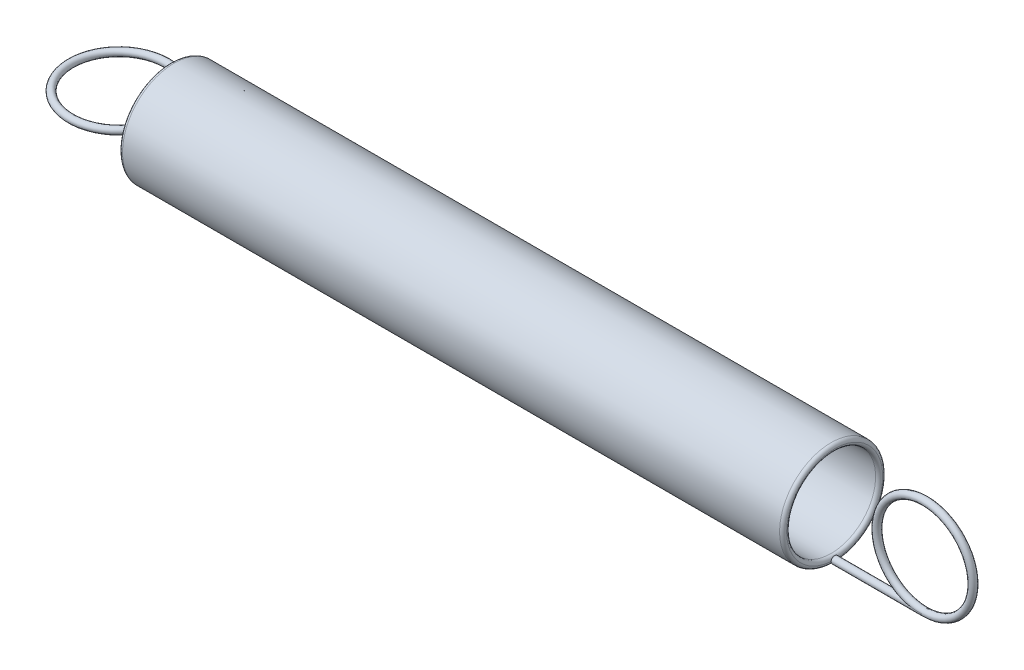
ISO-10303-21;
HEADER;
FILE_DESCRIPTION(('STEP AP214'),'2;1');
FILE_NAME('part.step','',(''),(''),'','','');
FILE_SCHEMA(('AUTOMOTIVE_DESIGN { 1 0 10303 214 1 1 1 1 }'));
ENDSEC;
DATA;
#1=APPLICATION_CONTEXT('core data for automotive mechanical design processes');
#2=APPLICATION_PROTOCOL_DEFINITION('international standard','automotive_design',2000,#1);
#3=PRODUCT_CONTEXT('',#1,'mechanical');
#4=PRODUCT('Part','Part','',(#3));
#5=PRODUCT_RELATED_PRODUCT_CATEGORY('part','',(#4));
#6=PRODUCT_DEFINITION_FORMATION('','',#4);
#7=PRODUCT_DEFINITION_CONTEXT('part definition',#1,'design');
#8=PRODUCT_DEFINITION('design','',#6,#7);
#9=PRODUCT_DEFINITION_SHAPE('','',#8);
#10=(LENGTH_UNIT() NAMED_UNIT(*) SI_UNIT(.MILLI.,.METRE.));
#11=(NAMED_UNIT(*) PLANE_ANGLE_UNIT() SI_UNIT($,.RADIAN.));
#12=(NAMED_UNIT(*) SI_UNIT($,.STERADIAN.) SOLID_ANGLE_UNIT());
#13=UNCERTAINTY_MEASURE_WITH_UNIT(LENGTH_MEASURE(1.E-05),#10,'distance_accuracy_value','');
#14=(GEOMETRIC_REPRESENTATION_CONTEXT(3) GLOBAL_UNCERTAINTY_ASSIGNED_CONTEXT((#13)) GLOBAL_UNIT_ASSIGNED_CONTEXT((#10,
#11,#12)) REPRESENTATION_CONTEXT('',''));
#15=CARTESIAN_POINT('',(0.,0.,0.));
#16=DIRECTION('',(0.,0.,1.));
#17=DIRECTION('',(1.,0.,0.));
#18=AXIS2_PLACEMENT_3D('',#15,#16,#17);
#19=CARTESIAN_POINT('',(66.5,-3.725,0.));
#20=DIRECTION('',(-1.,0.,0.));
#21=DIRECTION('',(0.,0.,1.));
#22=AXIS2_PLACEMENT_3D('',#19,#20,#21);
#23=CYLINDRICAL_SURFACE('',#22,0.275);
#24=CARTESIAN_POINT('',(66.5,-3.725,0.));
#25=DIRECTION('',(1.,0.,0.));
#26=DIRECTION('',(0.,0.,-1.));
#27=AXIS2_PLACEMENT_3D('',#24,#25,#26);
#28=CIRCLE('',#27,0.275);
#29=CARTESIAN_POINT('',(66.5,-3.725,0.275));
#30=VERTEX_POINT('',#29);
#31=CARTESIAN_POINT('',(66.5,-3.725,-0.275));
#32=VERTEX_POINT('',#31);
#33=EDGE_CURVE('E12',#30,#32,#28,.T.);
#34=ORIENTED_EDGE('',*,*,#33,.F.);
#35=CARTESIAN_POINT('',(66.5,-3.725,0.275));
#36=CARTESIAN_POINT('',(66.4712280847813,-3.72500001379458,0.27499969519662));
#37=CARTESIAN_POINT('',(66.4424563495826,-3.72483331828989,0.275000124930359));
#38=CARTESIAN_POINT('',(66.4015992865078,-3.72435995947143,0.274999301992739));
#39=CARTESIAN_POINT('',(66.3895123091085,-3.72419050700876,0.274998880387503));
#40=CARTESIAN_POINT('',(66.3737055532412,-3.72393043978386,0.274997926907629));
#41=CARTESIAN_POINT('',(66.3699853322933,-3.72386644456711,0.274997673367113));
#42=CARTESIAN_POINT('',(66.3513844251557,-3.72353254056616,0.274996208223023));
#43=CARTESIAN_POINT('',(66.3365045195097,-3.72322085102561,0.274994404304387));
#44=CARTESIAN_POINT('',(66.2621055938284,-3.72143950348469,0.274980927521272));
#45=CARTESIAN_POINT('',(66.2026003949151,-3.71930133763202,0.274955883343978));
#46=CARTESIAN_POINT('',(66.113975707044,-3.71505606385358,0.274823628046419));
#47=CARTESIAN_POINT('',(66.0848290125994,-3.7134887002372,0.274764808341643));
#48=CARTESIAN_POINT('',(66.0265853146739,-3.71001517883315,0.274596599238814));
#49=CARTESIAN_POINT('',(65.9974882905311,-3.70810935649524,0.274487259741123));
#50=CARTESIAN_POINT('',(65.85230657267,-3.69774937678202,0.273778129453111));
#51=CARTESIAN_POINT('',(65.7363832367892,-3.68676086026332,0.272689628655435));
#52=CARTESIAN_POINT('',(65.5625105380808,-3.6662427703071,0.268737190741643));
#53=CARTESIAN_POINT('',(65.5042933101482,-3.65868764899159,0.267020066389705));
#54=CARTESIAN_POINT('',(65.3881493952221,-3.6422587354897,0.262397555142851));
#55=CARTESIAN_POINT('',(65.3302224670648,-3.63338633846016,0.259493419801992));
#56=CARTESIAN_POINT('',(65.2137370366673,-3.6141930582664,0.25190263365944));
#57=CARTESIAN_POINT('',(65.1551838986879,-3.60385067739264,0.24718734273978));
#58=CARTESIAN_POINT('',(65.0383261487939,-3.58184107294053,0.235141565496124));
#59=CARTESIAN_POINT('',(64.9800234624114,-3.57016872487003,0.227800713341175));
#60=CARTESIAN_POINT('',(64.8938207365118,-3.55191234798824,0.213825774841388));
#61=CARTESIAN_POINT('',(64.8655774281724,-3.54576867997566,0.208740022516203));
#62=CARTESIAN_POINT('',(64.8093641289986,-3.53322415089895,0.197281754727986));
#63=CARTESIAN_POINT('',(64.7813945137103,-3.52682298516003,0.190907676754659));
#64=CARTESIAN_POINT('',(64.7261525105392,-3.51387406971724,0.176476464197976));
#65=CARTESIAN_POINT('',(64.6988765400401,-3.50732771746213,0.168431853859438));
#66=CARTESIAN_POINT('',(64.6452034042122,-3.49415713448275,0.149898383610407));
#67=CARTESIAN_POINT('',(64.6188039925476,-3.48753317306669,0.139416429040107));
#68=CARTESIAN_POINT('',(64.5834092793234,-3.47847522597202,0.121983090622443));
#69=CARTESIAN_POINT('',(64.5735953739375,-3.47594347502283,0.116762543312443));
#70=CARTESIAN_POINT('',(64.5543717205177,-3.4709478395349,0.105457292495431));
#71=CARTESIAN_POINT('',(64.5449644379493,-3.46848439471134,0.099368079776791));
#72=CARTESIAN_POINT('',(64.5267529821225,-3.46368325614534,0.0859686157969601));
#73=CARTESIAN_POINT('',(64.5179619608322,-3.46134845307069,0.0786391690861382));
#74=CARTESIAN_POINT('',(64.5018606930413,-3.45704712827454,0.0624166766903011));
#75=CARTESIAN_POINT('',(64.4945371845846,-3.45507732155857,0.0535391311062645));
#76=CARTESIAN_POINT('',(64.486370303829,-3.45287256509121,0.0398350915447601));
#77=CARTESIAN_POINT('',(64.4842881699425,-3.45230933413955,0.0358102974211077));
#78=CARTESIAN_POINT('',(64.4807254521481,-3.451344522592,0.0274818173306096));
#79=CARTESIAN_POINT('',(64.4792443473692,-3.4509428020289,0.0231783766149156));
#80=CARTESIAN_POINT('',(64.4770126116689,-3.45033713824787,0.0143222425391655));
#81=CARTESIAN_POINT('',(64.4762691992202,-3.45013514951324,0.00976753775457411));
#82=CARTESIAN_POINT('',(64.4756335964019,-3.44996246881461,0.000594444817595306));
#83=CARTESIAN_POINT('',(64.4757409929682,-3.4499916646115,-0.00402391134523852));
#84=CARTESIAN_POINT('',(64.4767376826841,-3.45026240057946,-0.0126973105785785));
#85=CARTESIAN_POINT('',(64.4775479189999,-3.45048247051588,-0.0167625938505264));
#86=CARTESIAN_POINT('',(64.4797636592697,-3.45108364776737,-0.0247136334549477));
#87=CARTESIAN_POINT('',(64.4811695799858,-3.4514648678284,-0.0285992619794977));
#88=CARTESIAN_POINT('',(64.4853064471489,-3.45258496394368,-0.0380501427361098));
#89=CARTESIAN_POINT('',(64.4883478084199,-3.45340718432077,-0.0434685567231494));
#90=CARTESIAN_POINT('',(64.4951996504,-3.45525419102234,-0.0537553806880108));
#91=CARTESIAN_POINT('',(64.4990123329713,-3.45627955708192,-0.0586221524112018));
#92=CARTESIAN_POINT('',(64.5105784062294,-3.45937966651754,-0.0717480310706061));
#93=CARTESIAN_POINT('',(64.5189493386911,-3.46161172635569,-0.0794180024369197));
#94=CARTESIAN_POINT('',(64.5366050579841,-3.46628588742423,-0.0935244603915056));
#95=CARTESIAN_POINT('',(64.5458925165218,-3.46872859993847,-0.0999571693732887));
#96=CARTESIAN_POINT('',(64.5703960855287,-3.47512421397303,-0.115284382854616));
#97=CARTESIAN_POINT('',(64.5860004754128,-3.47915152277947,-0.123519880548411));
#98=CARTESIAN_POINT('',(64.6178981204333,-3.48727848191075,-0.138510756543636));
#99=CARTESIAN_POINT('',(64.6341929183735,-3.49137828087703,-0.145262586036516));
#100=CARTESIAN_POINT('',(64.6672781692358,-3.49959097715507,-0.157707344917346));
#101=CARTESIAN_POINT('',(64.6840707817383,-3.5037038296288,-0.163394506270539));
#102=CARTESIAN_POINT('',(64.7179062369804,-3.5118743792721,-0.173915007827836));
#103=CARTESIAN_POINT('',(64.7349487607087,-3.51593213585423,-0.178749348658202));
#104=CARTESIAN_POINT('',(64.7863412905442,-3.52798961212088,-0.192246928344721));
#105=CARTESIAN_POINT('',(64.8209784920219,-3.53587907020319,-0.199912466286942));
#106=CARTESIAN_POINT('',(64.8906996984614,-3.55126655669794,-0.213411500213193));
#107=CARTESIAN_POINT('',(64.9257839825189,-3.55876432403806,-0.219243786955772));
#108=CARTESIAN_POINT('',(65.0316158303171,-3.5806258957754,-0.234745998747644));
#109=CARTESIAN_POINT('',(65.1027958778727,-3.59432346521815,-0.242388079661917));
#110=CARTESIAN_POINT('',(65.2457219489287,-3.6197584905341,-0.254444566659597));
#111=CARTESIAN_POINT('',(65.3174678598486,-3.63149632649047,-0.258859599179669));
#112=CARTESIAN_POINT('',(65.4612744359935,-3.65293368095697,-0.265627366485893));
#113=CARTESIAN_POINT('',(65.5333346545883,-3.66263548501663,-0.267982423214189));
#114=CARTESIAN_POINT('',(65.6677097421198,-3.67876916663637,-0.27119173823546));
#115=CARTESIAN_POINT('',(65.72998952562,-3.68546797053465,-0.272208892210862));
#116=CARTESIAN_POINT('',(65.854638887108,-3.69730797829597,-0.27366740024469));
#117=CARTESIAN_POINT('',(65.9170083045082,-3.70245079368769,-0.274109351614956));
#118=CARTESIAN_POINT('',(66.0171804316208,-3.70945037289089,-0.274572429735777));
#119=CARTESIAN_POINT('',(66.0549489562449,-3.71180250380219,-0.274690846565573));
#120=CARTESIAN_POINT('',(66.1305244046194,-3.71593395163639,-0.274858363790165));
#121=CARTESIAN_POINT('',(66.1683313340343,-3.71771316591776,-0.274907451769602));
#122=CARTESIAN_POINT('',(66.2503001141508,-3.72094625307345,-0.274975681889645));
#123=CARTESIAN_POINT('',(66.2944661445309,-3.72229577905469,-0.274988434194472));
#124=CARTESIAN_POINT('',(66.3636534810176,-3.72379431762446,-0.274997853257845));
#125=CARTESIAN_POINT('',(66.3886693153489,-3.7242101545623,-0.274999097952198));
#126=CARTESIAN_POINT('',(66.4424563688871,-3.72483332056101,-0.275000060078828));
#127=CARTESIAN_POINT('',(66.4712280614434,-3.72500001905505,-0.274999520427269));
#128=CARTESIAN_POINT('',(66.5,-3.725,-0.275));
#129=B_SPLINE_CURVE_WITH_KNOTS('',3,(#35,#36,#37,#38,#39,#40,#41,#42,#43,#44,#45,#46,#47,#48,
#49,#50,#51,#52,#53,#54,#55,#56,#57,#58,#59,#60,#61,#62,#63,#64,#65,#66,#67,#68,#69,#70,#71,#72,
#73,#74,#75,#76,#77,#78,#79,#80,#81,#82,#83,#84,#85,#86,#87,#88,#89,#90,#91,#92,#93,#94,#95,#96,
#97,#98,#99,#100,#101,#102,#103,#104,#105,#106,#107,#108,#109,#110,#111,#112,#113,#114,#115,
#116,#117,#118,#119,#120,#121,#122,#123,#124,#125,#126,#127,#128),.UNSPECIFIED.,.F.,.F.,(4,2,2,
2,2,2,2,2,2,2,2,2,2,2,2,2,2,2,2,2,2,2,2,2,2,2,2,2,2,2,2,2,2,2,2,2,2,2,2,2,2,2,2,2,2,2,4),(0.,
0.0863148307083176,0.122579190915519,0.133741499195725,0.17839092007752,0.357000618452914,
0.444565332406017,0.532043739583332,0.881207373914914,1.05738060345196,1.23336855765243,
1.41226232311085,1.59187030980309,1.6798933505843,1.7680237952861,1.8555159372392,
1.94276315842717,1.97693925081384,2.01129968253442,2.04625094450702,2.08087048911637,
2.0945287529096,2.1081751546099,2.12195380991387,2.13572577614845,2.14812409080372,
2.16053109412425,2.17922630979922,2.19797566681167,2.23249289791313,2.2671138998181,
2.3212701015586,2.37555446340032,2.43012490927239,2.48463089473913,2.59357052677575,
2.70258186704819,2.92106543590476,3.13950658132132,3.35770118804592,3.54562169963718,
3.7333469114484,3.84686867861212,3.9604107725944,4.09296304858644,4.16801980418973,
4.25433463489806),.UNSPECIFIED.);
#130=EDGE_CURVE('E56',#30,#32,#129,.T.);
#131=ORIENTED_EDGE('',*,*,#130,.T.);
#132=EDGE_LOOP('',(#34,#131));
#133=FACE_BOUND('',#132,.T.);
#134=CARTESIAN_POINT('',(59.5,-3.725,0.));
#135=DIRECTION('',(1.,0.,0.));
#136=DIRECTION('',(0.,0.,-1.));
#137=AXIS2_PLACEMENT_3D('',#134,#135,#136);
#138=CIRCLE('',#137,0.275);
#139=CARTESIAN_POINT('',(59.5,-3.725,-0.275));
#140=VERTEX_POINT('',#139);
#141=EDGE_CURVE('E46',#140,#140,#138,.T.);
#142=ORIENTED_EDGE('',*,*,#141,.T.);
#143=EDGE_LOOP('',(#142));
#144=FACE_BOUND('',#143,.T.);
#145=ADVANCED_FACE('F42',(#133,#144),#23,.T.);
#146=CARTESIAN_POINT('',(59.5,-3.725,0.));
#147=DIRECTION('',(1.,0.,0.));
#148=DIRECTION('',(0.,0.,-1.));
#149=AXIS2_PLACEMENT_3D('',#146,#147,#148);
#150=PLANE('',#149);
#151=ORIENTED_EDGE('',*,*,#141,.F.);
#152=EDGE_LOOP('',(#151));
#153=FACE_BOUND('',#152,.T.);
#154=ADVANCED_FACE('F62',(#153),#150,.F.);
#155=CARTESIAN_POINT('',(66.5,0.,0.));
#156=DIRECTION('',(0.,0.,1.));
#157=DIRECTION('',(1.,0.,0.));
#158=AXIS2_PLACEMENT_3D('',#155,#156,#157);
#159=TOROIDAL_SURFACE('',#158,3.725,0.275);
#160=ORIENTED_EDGE('',*,*,#33,.T.);
#161=ORIENTED_EDGE('',*,*,#130,.F.);
#162=EDGE_LOOP('',(#160,#161));
#163=FACE_BOUND('',#162,.T.);
#164=ADVANCED_FACE('F60',(#163),#159,.T.);
#165=CLOSED_SHELL('',(#145,#154,#164));
#166=MANIFOLD_SOLID_BREP('B2',#165);
#167=CARTESIAN_POINT('',(8.,0.,0.));
#168=DIRECTION('',(-1.,0.,0.));
#169=DIRECTION('',(0.,0.,1.));
#170=AXIS2_PLACEMENT_3D('',#167,#168,#169);
#171=CYLINDRICAL_SURFACE('',#170,3.45);
#172=CARTESIAN_POINT('',(59.225,0.,0.));
#173=DIRECTION('',(-1.,0.,0.));
#174=DIRECTION('',(0.,0.,1.));
#175=AXIS2_PLACEMENT_3D('',#172,#173,#174);
#176=CIRCLE('',#175,3.45);
#177=CARTESIAN_POINT('',(59.225,0.,3.45));
#178=VERTEX_POINT('',#177);
#179=EDGE_CURVE('E113',#178,#178,#176,.F.);
#180=ORIENTED_EDGE('',*,*,#179,.T.);
#181=EDGE_LOOP('',(#180));
#182=FACE_BOUND('',#181,.T.);
#183=CARTESIAN_POINT('',(8.275,0.,0.));
#184=DIRECTION('',(1.,0.,0.));
#185=DIRECTION('',(0.,0.,-1.));
#186=AXIS2_PLACEMENT_3D('',#183,#184,#185);
#187=CIRCLE('',#186,3.45);
#188=CARTESIAN_POINT('',(8.275,0.,-3.45));
#189=VERTEX_POINT('',#188);
#190=EDGE_CURVE('E118',#189,#189,#187,.F.);
#191=ORIENTED_EDGE('',*,*,#190,.T.);
#192=EDGE_LOOP('',(#191));
#193=FACE_BOUND('',#192,.T.);
#194=ADVANCED_FACE('F100',(#182,#193),#171,.F.);
#195=CARTESIAN_POINT('',(8.,0.,0.));
#196=DIRECTION('',(-1.,0.,0.));
#197=DIRECTION('',(0.,0.,1.));
#198=AXIS2_PLACEMENT_3D('',#195,#196,#197);
#199=CYLINDRICAL_SURFACE('',#198,4.);
#200=CARTESIAN_POINT('',(59.225,0.,0.));
#201=DIRECTION('',(-1.,0.,0.));
#202=DIRECTION('',(0.,0.,1.));
#203=AXIS2_PLACEMENT_3D('',#200,#201,#202);
#204=CIRCLE('',#203,4.);
#205=CARTESIAN_POINT('',(59.225,0.,4.));
#206=VERTEX_POINT('',#205);
#207=EDGE_CURVE('E41',#206,#206,#204,.T.);
#208=ORIENTED_EDGE('',*,*,#207,.T.);
#209=EDGE_LOOP('',(#208));
#210=FACE_BOUND('',#209,.T.);
#211=CARTESIAN_POINT('',(8.275,0.,0.));
#212=DIRECTION('',(1.,0.,0.));
#213=DIRECTION('',(0.,0.,-1.));
#214=AXIS2_PLACEMENT_3D('',#211,#212,#213);
#215=CIRCLE('',#214,4.);
#216=CARTESIAN_POINT('',(8.275,0.,-4.));
#217=VERTEX_POINT('',#216);
#218=EDGE_CURVE('E108',#217,#217,#215,.T.);
#219=ORIENTED_EDGE('',*,*,#218,.T.);
#220=EDGE_LOOP('',(#219));
#221=FACE_BOUND('',#220,.T.);
#222=ADVANCED_FACE('F141',(#210,#221),#199,.T.);
#223=CARTESIAN_POINT('',(59.225,0.,0.));
#224=DIRECTION('',(-1.,0.,0.));
#225=DIRECTION('',(0.,0.,1.));
#226=AXIS2_PLACEMENT_3D('',#223,#224,#225);
#227=TOROIDAL_SURFACE('',#226,3.725,0.275);
#228=ORIENTED_EDGE('',*,*,#207,.F.);
#229=EDGE_LOOP('',(#228));
#230=FACE_BOUND('',#229,.T.);
#231=CARTESIAN_POINT('',(59.5,0.,0.));
#232=DIRECTION('',(-1.,0.,0.));
#233=DIRECTION('',(0.,0.,1.));
#234=AXIS2_PLACEMENT_3D('',#231,#232,#233);
#235=CIRCLE('',#234,3.725);
#236=CARTESIAN_POINT('',(59.5,0.,3.725));
#237=VERTEX_POINT('',#236);
#238=EDGE_CURVE('E116',#237,#237,#235,.F.);
#239=ORIENTED_EDGE('',*,*,#238,.F.);
#240=EDGE_LOOP('',(#239));
#241=FACE_BOUND('',#240,.T.);
#242=ADVANCED_FACE('F136',(#230,#241),#227,.T.);
#243=CARTESIAN_POINT('',(59.225,0.,0.));
#244=DIRECTION('',(-1.,0.,0.));
#245=DIRECTION('',(0.,0.,1.));
#246=AXIS2_PLACEMENT_3D('',#243,#244,#245);
#247=TOROIDAL_SURFACE('',#246,3.725,0.275);
#248=ORIENTED_EDGE('',*,*,#179,.F.);
#249=EDGE_LOOP('',(#248));
#250=FACE_BOUND('',#249,.T.);
#251=ORIENTED_EDGE('',*,*,#238,.T.);
#252=EDGE_LOOP('',(#251));
#253=FACE_BOUND('',#252,.T.);
#254=ADVANCED_FACE('F130',(#250,#253),#247,.T.);
#255=CARTESIAN_POINT('',(8.275,0.,0.));
#256=DIRECTION('',(1.,0.,0.));
#257=DIRECTION('',(0.,0.,-1.));
#258=AXIS2_PLACEMENT_3D('',#255,#256,#257);
#259=TOROIDAL_SURFACE('',#258,3.725,0.275);
#260=ORIENTED_EDGE('',*,*,#218,.F.);
#261=EDGE_LOOP('',(#260));
#262=FACE_BOUND('',#261,.T.);
#263=CARTESIAN_POINT('',(8.,0.,0.));
#264=DIRECTION('',(1.,0.,0.));
#265=DIRECTION('',(0.,0.,-1.));
#266=AXIS2_PLACEMENT_3D('',#263,#264,#265);
#267=CIRCLE('',#266,3.725);
#268=CARTESIAN_POINT('',(8.,0.,-3.725));
#269=VERTEX_POINT('',#268);
#270=EDGE_CURVE('E104',#269,#269,#267,.F.);
#271=ORIENTED_EDGE('',*,*,#270,.F.);
#272=EDGE_LOOP('',(#271));
#273=FACE_BOUND('',#272,.T.);
#274=ADVANCED_FACE('F102',(#262,#273),#259,.T.);
#275=CARTESIAN_POINT('',(8.275,0.,0.));
#276=DIRECTION('',(1.,0.,0.));
#277=DIRECTION('',(0.,0.,-1.));
#278=AXIS2_PLACEMENT_3D('',#275,#276,#277);
#279=TOROIDAL_SURFACE('',#278,3.725,0.275);
#280=ORIENTED_EDGE('',*,*,#270,.T.);
#281=EDGE_LOOP('',(#280));
#282=FACE_BOUND('',#281,.T.);
#283=ORIENTED_EDGE('',*,*,#190,.F.);
#284=EDGE_LOOP('',(#283));
#285=FACE_BOUND('',#284,.T.);
#286=ADVANCED_FACE('F126',(#282,#285),#279,.T.);
#287=CLOSED_SHELL('',(#194,#222,#242,#254,#274,#286));
#288=MANIFOLD_SOLID_BREP('B6',#287);
#289=CARTESIAN_POINT('',(4.,0.,0.));
#290=DIRECTION('',(0.,-1.,0.));
#291=DIRECTION('',(0.,0.,-1.));
#292=AXIS2_PLACEMENT_3D('',#289,#290,#291);
#293=TOROIDAL_SURFACE('',#292,3.725,0.275);
#294=CARTESIAN_POINT('',(4.,0.,-4.));
#295=VERTEX_POINT('',#294);
#296=VERTEX_LOOP('',#295);
#297=FACE_BOUND('',#296,.T.);
#298=ADVANCED_FACE('F192',(#297),#293,.T.);
#299=CLOSED_SHELL('',(#298));
#300=MANIFOLD_SOLID_BREP('B36',#299);
#301=ADVANCED_BREP_SHAPE_REPRESENTATION('',(#18,#166,#288,#300),#14);
#302=SHAPE_DEFINITION_REPRESENTATION(#9,#301);
ENDSEC;
END-ISO-10303-21;
